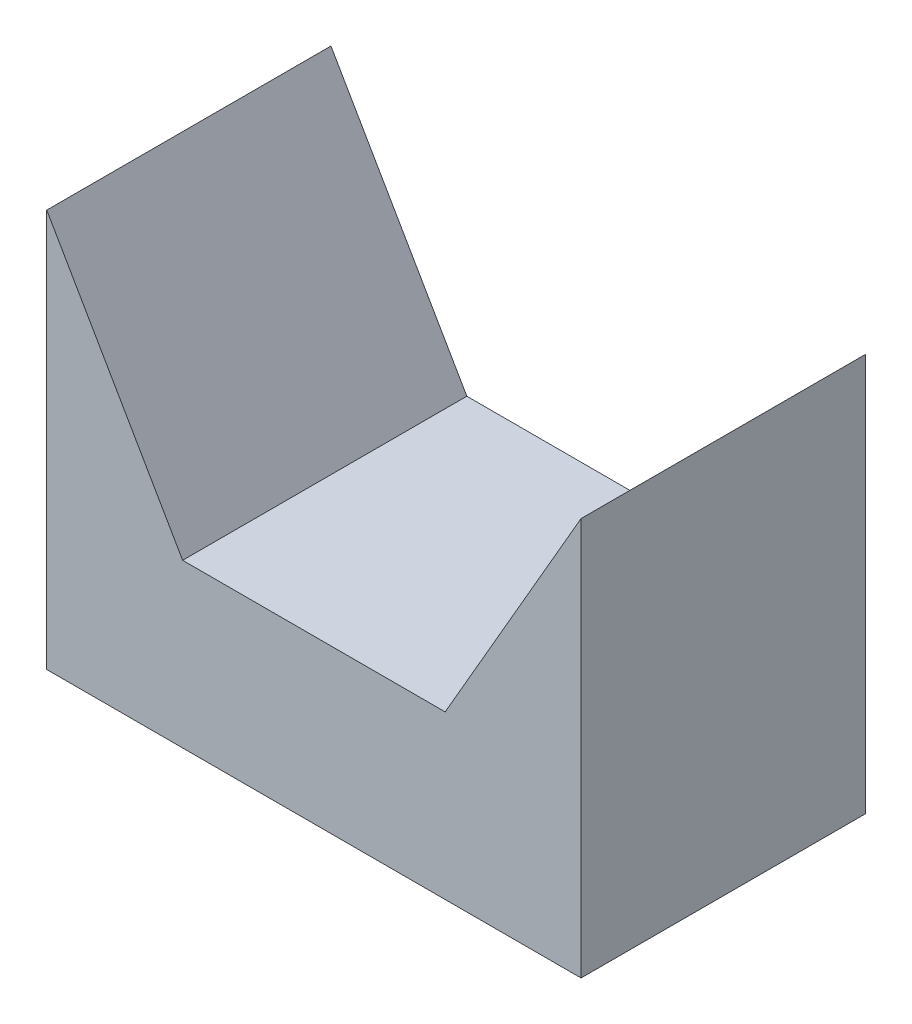
ISO-10303-21;
HEADER;
FILE_DESCRIPTION(('STEP AP214'),'2;1');
FILE_NAME('part.step','',(''),(''),'','','');
FILE_SCHEMA(('AUTOMOTIVE_DESIGN { 1 0 10303 214 1 1 1 1 }'));
ENDSEC;
DATA;
#1=APPLICATION_CONTEXT('core data for automotive mechanical design processes');
#2=APPLICATION_PROTOCOL_DEFINITION('international standard','automotive_design',2000,#1);
#3=PRODUCT_CONTEXT('',#1,'mechanical');
#4=PRODUCT('Part','Part','',(#3));
#5=PRODUCT_RELATED_PRODUCT_CATEGORY('part','',(#4));
#6=PRODUCT_DEFINITION_FORMATION('','',#4);
#7=PRODUCT_DEFINITION_CONTEXT('part definition',#1,'design');
#8=PRODUCT_DEFINITION('design','',#6,#7);
#9=PRODUCT_DEFINITION_SHAPE('','',#8);
#10=(LENGTH_UNIT() NAMED_UNIT(*) SI_UNIT(.MILLI.,.METRE.));
#11=(NAMED_UNIT(*) PLANE_ANGLE_UNIT() SI_UNIT($,.RADIAN.));
#12=(NAMED_UNIT(*) SI_UNIT($,.STERADIAN.) SOLID_ANGLE_UNIT());
#13=UNCERTAINTY_MEASURE_WITH_UNIT(LENGTH_MEASURE(1.E-05),#10,'distance_accuracy_value','');
#14=(GEOMETRIC_REPRESENTATION_CONTEXT(3) GLOBAL_UNCERTAINTY_ASSIGNED_CONTEXT((#13)) GLOBAL_UNIT_ASSIGNED_CONTEXT((#10,
#11,#12)) REPRESENTATION_CONTEXT('',''));
#15=CARTESIAN_POINT('',(0.,0.,0.));
#16=DIRECTION('',(0.,0.,1.));
#17=DIRECTION('',(1.,0.,0.));
#18=AXIS2_PLACEMENT_3D('',#15,#16,#17);
#19=CARTESIAN_POINT('',(-4.7,-6.85936120442633,9.11561056074564));
#20=DIRECTION('',(0.,1.,0.));
#21=DIRECTION('',(-1.,0.,0.));
#22=AXIS2_PLACEMENT_3D('',#19,#20,#21);
#23=PLANE('',#22);
#24=DIRECTION('',(1.,0.,0.));
#25=VECTOR('',#24,1.);
#26=CARTESIAN_POINT('',(-4.7,-6.85936120442633,4.11561056074564));
#27=LINE('',#26,#25);
#28=CARTESIAN_POINT('',(-4.7,-6.85936120442633,4.11561056074564));
#29=VERTEX_POINT('',#28);
#30=CARTESIAN_POINT('',(4.7,-6.85936120442632,4.11561056074564));
#31=VERTEX_POINT('',#30);
#32=EDGE_CURVE('E121',#29,#31,#27,.T.);
#33=ORIENTED_EDGE('',*,*,#32,.T.);
#34=DIRECTION('',(0.,0.,-1.));
#35=VECTOR('',#34,1.);
#36=CARTESIAN_POINT('',(4.7,-6.85936120442632,9.11561056074564));
#37=LINE('',#36,#35);
#38=CARTESIAN_POINT('',(4.7,-6.85936120442632,9.11561056074564));
#39=VERTEX_POINT('',#38);
#40=EDGE_CURVE('E11',#39,#31,#37,.T.);
#41=ORIENTED_EDGE('',*,*,#40,.F.);
#42=DIRECTION('',(1.,0.,0.));
#43=VECTOR('',#42,1.);
#44=CARTESIAN_POINT('',(-4.7,-6.85936120442633,9.11561056074564));
#45=LINE('',#44,#43);
#46=CARTESIAN_POINT('',(-4.7,-6.85936120442633,9.11561056074564));
#47=VERTEX_POINT('',#46);
#48=EDGE_CURVE('E131',#47,#39,#45,.T.);
#49=ORIENTED_EDGE('',*,*,#48,.F.);
#50=DIRECTION('',(0.,0.,-1.));
#51=VECTOR('',#50,1.);
#52=CARTESIAN_POINT('',(-4.7,-6.85936120442633,9.11561056074564));
#53=LINE('',#52,#51);
#54=EDGE_CURVE('E117',#47,#29,#53,.T.);
#55=ORIENTED_EDGE('',*,*,#54,.T.);
#56=EDGE_LOOP('',(#33,#41,#49,#55));
#57=FACE_BOUND('',#56,.T.);
#58=ADVANCED_FACE('F37',(#57),#23,.F.);
#59=CARTESIAN_POINT('',(4.7,-6.85936120442632,9.11561056074564));
#60=DIRECTION('',(-1.,0.,0.));
#61=DIRECTION('',(0.,0.,1.));
#62=AXIS2_PLACEMENT_3D('',#59,#60,#61);
#63=PLANE('',#62);
#64=DIRECTION('',(0.,1.,0.));
#65=VECTOR('',#64,1.);
#66=CARTESIAN_POINT('',(4.7,-6.85936120442632,4.11561056074564));
#67=LINE('',#66,#65);
#68=CARTESIAN_POINT('',(4.7,0.140638795573677,4.11561056074564));
#69=VERTEX_POINT('',#68);
#70=EDGE_CURVE('E124',#31,#69,#67,.T.);
#71=ORIENTED_EDGE('',*,*,#70,.T.);
#72=DIRECTION('',(0.,0.,-1.));
#73=VECTOR('',#72,1.);
#74=CARTESIAN_POINT('',(4.7,0.140638795573677,9.11561056074564));
#75=LINE('',#74,#73);
#76=CARTESIAN_POINT('',(4.7,0.140638795573677,9.11561056074564));
#77=VERTEX_POINT('',#76);
#78=EDGE_CURVE('E45',#77,#69,#75,.T.);
#79=ORIENTED_EDGE('',*,*,#78,.F.);
#80=DIRECTION('',(0.,1.,0.));
#81=VECTOR('',#80,1.);
#82=CARTESIAN_POINT('',(4.7,-6.85936120442632,9.11561056074564));
#83=LINE('',#82,#81);
#84=EDGE_CURVE('E90',#39,#77,#83,.T.);
#85=ORIENTED_EDGE('',*,*,#84,.F.);
#86=ORIENTED_EDGE('',*,*,#40,.T.);
#87=EDGE_LOOP('',(#71,#79,#85,#86));
#88=FACE_BOUND('',#87,.T.);
#89=ADVANCED_FACE('F155',(#88),#63,.F.);
#90=CARTESIAN_POINT('',(2.30940107675852,-4.00000000000003,9.11561056074564));
#91=DIRECTION('',(0.86602540378444,-0.499999999999998,0.));
#92=DIRECTION('',(0.499999999999998,0.86602540378444,0.));
#93=AXIS2_PLACEMENT_3D('',#90,#91,#92);
#94=PLANE('',#93);
#95=DIRECTION('',(-0.499999999999999,-0.86602540378444,0.));
#96=VECTOR('',#95,1.);
#97=CARTESIAN_POINT('',(2.30940107675852,-4.00000000000003,4.11561056074564));
#98=LINE('',#97,#96);
#99=CARTESIAN_POINT('',(2.30940107675852,-4.00000000000003,4.11561056074564));
#100=VERTEX_POINT('',#99);
#101=EDGE_CURVE('E126',#69,#100,#98,.T.);
#102=ORIENTED_EDGE('',*,*,#101,.T.);
#103=DIRECTION('',(0.,0.,-1.));
#104=VECTOR('',#103,1.);
#105=CARTESIAN_POINT('',(2.30940107675852,-4.00000000000003,9.11561056074564));
#106=LINE('',#105,#104);
#107=CARTESIAN_POINT('',(2.30940107675852,-4.00000000000003,9.11561056074564));
#108=VERTEX_POINT('',#107);
#109=EDGE_CURVE('E112',#108,#100,#106,.T.);
#110=ORIENTED_EDGE('',*,*,#109,.F.);
#111=DIRECTION('',(-0.499999999999999,-0.86602540378444,0.));
#112=VECTOR('',#111,1.);
#113=CARTESIAN_POINT('',(2.30940107675852,-4.00000000000003,9.11561056074564));
#114=LINE('',#113,#112);
#115=EDGE_CURVE('E103',#77,#108,#114,.T.);
#116=ORIENTED_EDGE('',*,*,#115,.F.);
#117=ORIENTED_EDGE('',*,*,#78,.T.);
#118=EDGE_LOOP('',(#102,#110,#116,#117));
#119=FACE_BOUND('',#118,.T.);
#120=ADVANCED_FACE('F137',(#119),#94,.F.);
#121=CARTESIAN_POINT('',(-2.30940107675853,-4.00000000000002,9.11561056074564));
#122=DIRECTION('',(0.,-1.,0.));
#123=DIRECTION('',(1.,0.,0.));
#124=AXIS2_PLACEMENT_3D('',#121,#122,#123);
#125=PLANE('',#124);
#126=DIRECTION('',(-1.,0.,0.));
#127=VECTOR('',#126,1.);
#128=CARTESIAN_POINT('',(-2.30940107675853,-4.00000000000002,4.11561056074564));
#129=LINE('',#128,#127);
#130=CARTESIAN_POINT('',(-2.30940107675853,-4.00000000000002,4.11561056074564));
#131=VERTEX_POINT('',#130);
#132=EDGE_CURVE('E111',#100,#131,#129,.T.);
#133=ORIENTED_EDGE('',*,*,#132,.T.);
#134=DIRECTION('',(0.,0.,-1.));
#135=VECTOR('',#134,1.);
#136=CARTESIAN_POINT('',(-2.30940107675853,-4.00000000000002,9.11561056074564));
#137=LINE('',#136,#135);
#138=CARTESIAN_POINT('',(-2.30940107675853,-4.00000000000002,9.11561056074564));
#139=VERTEX_POINT('',#138);
#140=EDGE_CURVE('E108',#139,#131,#137,.T.);
#141=ORIENTED_EDGE('',*,*,#140,.F.);
#142=DIRECTION('',(-1.,0.,0.));
#143=VECTOR('',#142,1.);
#144=CARTESIAN_POINT('',(-2.30940107675853,-4.00000000000002,9.11561056074564));
#145=LINE('',#144,#143);
#146=EDGE_CURVE('E97',#108,#139,#145,.T.);
#147=ORIENTED_EDGE('',*,*,#146,.F.);
#148=ORIENTED_EDGE('',*,*,#109,.T.);
#149=EDGE_LOOP('',(#133,#141,#147,#148));
#150=FACE_BOUND('',#149,.T.);
#151=ADVANCED_FACE('F109',(#150),#125,.F.);
#152=CARTESIAN_POINT('',(-4.7,0.140638795573676,9.11561056074564));
#153=DIRECTION('',(-0.866025403784439,-0.499999999999999,0.));
#154=DIRECTION('',(0.499999999999999,-0.866025403784439,0.));
#155=AXIS2_PLACEMENT_3D('',#152,#153,#154);
#156=PLANE('',#155);
#157=DIRECTION('',(-0.499999999999999,0.866025403784439,0.));
#158=VECTOR('',#157,1.);
#159=CARTESIAN_POINT('',(-4.7,0.140638795573676,4.11561056074564));
#160=LINE('',#159,#158);
#161=CARTESIAN_POINT('',(-4.7,0.140638795573676,4.11561056074564));
#162=VERTEX_POINT('',#161);
#163=EDGE_CURVE('E76',#131,#162,#160,.T.);
#164=ORIENTED_EDGE('',*,*,#163,.T.);
#165=DIRECTION('',(0.,0.,-1.));
#166=VECTOR('',#165,1.);
#167=CARTESIAN_POINT('',(-4.7,0.140638795573676,9.11561056074564));
#168=LINE('',#167,#166);
#169=CARTESIAN_POINT('',(-4.7,0.140638795573676,9.11561056074564));
#170=VERTEX_POINT('',#169);
#171=EDGE_CURVE('E113',#170,#162,#168,.T.);
#172=ORIENTED_EDGE('',*,*,#171,.F.);
#173=DIRECTION('',(-0.499999999999999,0.866025403784439,0.));
#174=VECTOR('',#173,1.);
#175=CARTESIAN_POINT('',(-4.7,0.140638795573676,9.11561056074564));
#176=LINE('',#175,#174);
#177=EDGE_CURVE('E101',#139,#170,#176,.T.);
#178=ORIENTED_EDGE('',*,*,#177,.F.);
#179=ORIENTED_EDGE('',*,*,#140,.T.);
#180=EDGE_LOOP('',(#164,#172,#178,#179));
#181=FACE_BOUND('',#180,.T.);
#182=ADVANCED_FACE('F115',(#181),#156,.F.);
#183=CARTESIAN_POINT('',(-4.7,0.140638795573676,9.11561056074564));
#184=DIRECTION('',(1.,0.,0.));
#185=DIRECTION('',(0.,1.,0.));
#186=AXIS2_PLACEMENT_3D('',#183,#184,#185);
#187=PLANE('',#186);
#188=DIRECTION('',(0.,-1.,0.));
#189=VECTOR('',#188,1.);
#190=CARTESIAN_POINT('',(-4.7,0.140638795573676,4.11561056074564));
#191=LINE('',#190,#189);
#192=EDGE_CURVE('E82',#162,#29,#191,.T.);
#193=ORIENTED_EDGE('',*,*,#192,.T.);
#194=ORIENTED_EDGE('',*,*,#54,.F.);
#195=DIRECTION('',(0.,-1.,0.));
#196=VECTOR('',#195,1.);
#197=CARTESIAN_POINT('',(-4.7,0.140638795573676,9.11561056074564));
#198=LINE('',#197,#196);
#199=EDGE_CURVE('E53',#170,#47,#198,.T.);
#200=ORIENTED_EDGE('',*,*,#199,.F.);
#201=ORIENTED_EDGE('',*,*,#171,.T.);
#202=EDGE_LOOP('',(#193,#194,#200,#201));
#203=FACE_BOUND('',#202,.T.);
#204=ADVANCED_FACE('F144',(#203),#187,.F.);
#205=CARTESIAN_POINT('',(0.,0.,9.11561056074564));
#206=DIRECTION('',(0.,0.,1.));
#207=DIRECTION('',(1.,0.,0.));
#208=AXIS2_PLACEMENT_3D('',#205,#206,#207);
#209=PLANE('',#208);
#210=ORIENTED_EDGE('',*,*,#48,.T.);
#211=ORIENTED_EDGE('',*,*,#84,.T.);
#212=ORIENTED_EDGE('',*,*,#115,.T.);
#213=ORIENTED_EDGE('',*,*,#146,.T.);
#214=ORIENTED_EDGE('',*,*,#177,.T.);
#215=ORIENTED_EDGE('',*,*,#199,.T.);
#216=EDGE_LOOP('',(#210,#211,#212,#213,#214,#215));
#217=FACE_BOUND('',#216,.T.);
#218=ADVANCED_FACE('F99',(#217),#209,.T.);
#219=CARTESIAN_POINT('',(0.,0.,4.11561056074564));
#220=DIRECTION('',(0.,0.,1.));
#221=DIRECTION('',(1.,0.,0.));
#222=AXIS2_PLACEMENT_3D('',#219,#220,#221);
#223=PLANE('',#222);
#224=ORIENTED_EDGE('',*,*,#32,.F.);
#225=ORIENTED_EDGE('',*,*,#192,.F.);
#226=ORIENTED_EDGE('',*,*,#163,.F.);
#227=ORIENTED_EDGE('',*,*,#132,.F.);
#228=ORIENTED_EDGE('',*,*,#101,.F.);
#229=ORIENTED_EDGE('',*,*,#70,.F.);
#230=EDGE_LOOP('',(#224,#225,#226,#227,#228,#229));
#231=FACE_BOUND('',#230,.T.);
#232=ADVANCED_FACE('F140',(#231),#223,.F.);
#233=CLOSED_SHELL('',(#58,#89,#120,#151,#182,#204,#218,#232));
#234=MANIFOLD_SOLID_BREP('B2',#233);
#235=ADVANCED_BREP_SHAPE_REPRESENTATION('',(#18,#234),#14);
#236=SHAPE_DEFINITION_REPRESENTATION(#9,#235);
ENDSEC;
END-ISO-10303-21;
